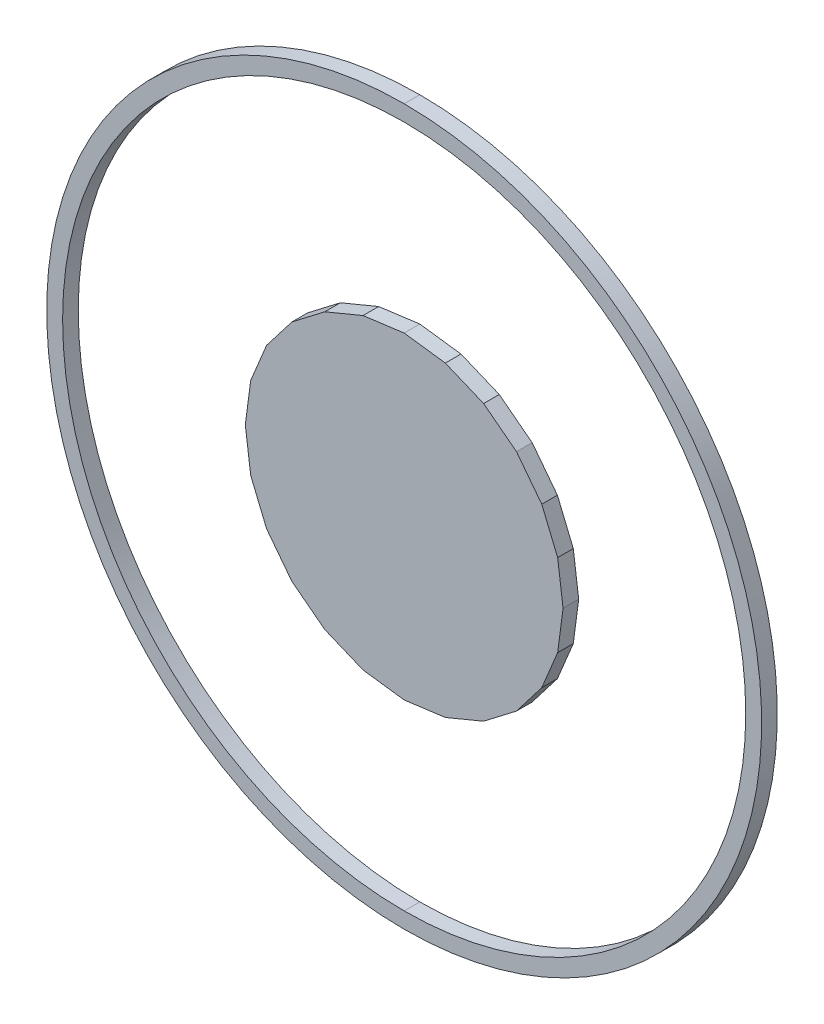
ISO-10303-21;
HEADER;
FILE_DESCRIPTION(('STEP AP214'),'2;1');
FILE_NAME('part.step','',(''),(''),'','','');
FILE_SCHEMA(('AUTOMOTIVE_DESIGN { 1 0 10303 214 1 1 1 1 }'));
ENDSEC;
DATA;
#1=APPLICATION_CONTEXT('core data for automotive mechanical design processes');
#2=APPLICATION_PROTOCOL_DEFINITION('international standard','automotive_design',2000,#1);
#3=PRODUCT_CONTEXT('',#1,'mechanical');
#4=PRODUCT('Part','Part','',(#3));
#5=PRODUCT_RELATED_PRODUCT_CATEGORY('part','',(#4));
#6=PRODUCT_DEFINITION_FORMATION('','',#4);
#7=PRODUCT_DEFINITION_CONTEXT('part definition',#1,'design');
#8=PRODUCT_DEFINITION('design','',#6,#7);
#9=PRODUCT_DEFINITION_SHAPE('','',#8);
#10=(LENGTH_UNIT() NAMED_UNIT(*) SI_UNIT(.MILLI.,.METRE.));
#11=(NAMED_UNIT(*) PLANE_ANGLE_UNIT() SI_UNIT($,.RADIAN.));
#12=(NAMED_UNIT(*) SI_UNIT($,.STERADIAN.) SOLID_ANGLE_UNIT());
#13=UNCERTAINTY_MEASURE_WITH_UNIT(LENGTH_MEASURE(1.E-05),#10,'distance_accuracy_value','');
#14=(GEOMETRIC_REPRESENTATION_CONTEXT(3) GLOBAL_UNCERTAINTY_ASSIGNED_CONTEXT((#13)) GLOBAL_UNIT_ASSIGNED_CONTEXT((#10,
#11,#12)) REPRESENTATION_CONTEXT('',''));
#15=CARTESIAN_POINT('',(0.,0.,0.));
#16=DIRECTION('',(0.,0.,1.));
#17=DIRECTION('',(1.,0.,0.));
#18=AXIS2_PLACEMENT_3D('',#15,#16,#17);
#19=CARTESIAN_POINT('',(0.,0.508,0.));
#20=DIRECTION('',(-0.130157426935396,0.991493340478673,0.));
#21=DIRECTION('',(0.,0.,1.));
#22=AXIS2_PLACEMENT_3D('',#19,#20,#21);
#23=PLANE('',#22);
#24=DIRECTION('',(0.,0.,1.));
#25=VECTOR('',#24,1.);
#26=CARTESIAN_POINT('',(-0.131572,0.490728,0.));
#27=LINE('',#26,#25);
#28=CARTESIAN_POINT('',(-0.131572,0.490728,0.));
#29=VERTEX_POINT('',#28);
#30=CARTESIAN_POINT('',(-0.131572,0.490728,0.05));
#31=VERTEX_POINT('',#30);
#32=EDGE_CURVE('P0_E11',#29,#31,#27,.T.);
#33=ORIENTED_EDGE('',*,*,#32,.T.);
#34=DIRECTION('',(-0.991493340478673,-0.130157426935396,0.));
#35=VECTOR('',#34,1.);
#36=CARTESIAN_POINT('',(0.,0.508,0.05));
#37=LINE('',#36,#35);
#38=CARTESIAN_POINT('',(0.,0.508,0.05));
#39=VERTEX_POINT('',#38);
#40=EDGE_CURVE('P0_E296',#39,#31,#37,.T.);
#41=ORIENTED_EDGE('',*,*,#40,.F.);
#42=DIRECTION('',(0.,0.,1.));
#43=VECTOR('',#42,1.);
#44=CARTESIAN_POINT('',(0.,0.508,0.));
#45=LINE('',#44,#43);
#46=CARTESIAN_POINT('',(0.,0.508,0.));
#47=VERTEX_POINT('',#46);
#48=EDGE_CURVE('P0_E423',#47,#39,#45,.T.);
#49=ORIENTED_EDGE('',*,*,#48,.F.);
#50=DIRECTION('',(-0.991493340478673,-0.130157426935396,0.));
#51=VECTOR('',#50,1.);
#52=CARTESIAN_POINT('',(0.,0.508,0.));
#53=LINE('',#52,#51);
#54=EDGE_CURVE('P0_E22',#47,#29,#53,.T.);
#55=ORIENTED_EDGE('',*,*,#54,.T.);
#56=EDGE_LOOP('',(#33,#41,#49,#55));
#57=FACE_BOUND('',#56,.T.);
#58=ADVANCED_FACE('P0_F18',(#57),#23,.T.);
#59=CARTESIAN_POINT('',(-0.131572,0.490728,0.));
#60=DIRECTION('',(-0.383254300605684,0.923642864459661,0.));
#61=DIRECTION('',(0.,0.,1.));
#62=AXIS2_PLACEMENT_3D('',#59,#60,#61);
#63=PLANE('',#62);
#64=DIRECTION('',(0.,0.,1.));
#65=VECTOR('',#64,1.);
#66=CARTESIAN_POINT('',(-0.254,0.439928,0.));
#67=LINE('',#66,#65);
#68=CARTESIAN_POINT('',(-0.254,0.439928,0.));
#69=VERTEX_POINT('',#68);
#70=CARTESIAN_POINT('',(-0.254,0.439928,0.05));
#71=VERTEX_POINT('',#70);
#72=EDGE_CURVE('P0_E29',#69,#71,#67,.T.);
#73=ORIENTED_EDGE('',*,*,#72,.T.);
#74=DIRECTION('',(-0.923642864459661,-0.383254300605684,0.));
#75=VECTOR('',#74,1.);
#76=CARTESIAN_POINT('',(-0.131572,0.490728,0.05));
#77=LINE('',#76,#75);
#78=EDGE_CURVE('P0_E304',#31,#71,#77,.T.);
#79=ORIENTED_EDGE('',*,*,#78,.F.);
#80=ORIENTED_EDGE('',*,*,#32,.F.);
#81=DIRECTION('',(-0.923642864459661,-0.383254300605684,0.));
#82=VECTOR('',#81,1.);
#83=CARTESIAN_POINT('',(-0.131572,0.490728,0.));
#84=LINE('',#83,#82);
#85=EDGE_CURVE('P0_E394',#29,#69,#84,.T.);
#86=ORIENTED_EDGE('',*,*,#85,.T.);
#87=EDGE_LOOP('',(#73,#79,#80,#86));
#88=FACE_BOUND('',#87,.T.);
#89=ADVANCED_FACE('P0_F535',(#88),#63,.T.);
#90=CARTESIAN_POINT('',(-0.254,0.439928,0.));
#91=DIRECTION('',(-0.609155163492906,0.793051061905808,0.));
#92=DIRECTION('',(0.,0.,1.));
#93=AXIS2_PLACEMENT_3D('',#90,#91,#92);
#94=PLANE('',#93);
#95=DIRECTION('',(0.,0.,1.));
#96=VECTOR('',#95,1.);
#97=CARTESIAN_POINT('',(-0.359156,0.359156,0.));
#98=LINE('',#97,#96);
#99=CARTESIAN_POINT('',(-0.359156,0.359156,0.));
#100=VERTEX_POINT('',#99);
#101=CARTESIAN_POINT('',(-0.359156,0.359156,0.05));
#102=VERTEX_POINT('',#101);
#103=EDGE_CURVE('P0_E271',#100,#102,#98,.T.);
#104=ORIENTED_EDGE('',*,*,#103,.T.);
#105=DIRECTION('',(-0.793051061905808,-0.609155163492907,0.));
#106=VECTOR('',#105,1.);
#107=CARTESIAN_POINT('',(-0.254,0.439928,0.05));
#108=LINE('',#107,#106);
#109=EDGE_CURVE('P0_E449',#71,#102,#108,.T.);
#110=ORIENTED_EDGE('',*,*,#109,.F.);
#111=ORIENTED_EDGE('',*,*,#72,.F.);
#112=DIRECTION('',(-0.793051061905808,-0.609155163492907,0.));
#113=VECTOR('',#112,1.);
#114=CARTESIAN_POINT('',(-0.254,0.439928,0.));
#115=LINE('',#114,#113);
#116=EDGE_CURVE('P0_E279',#69,#100,#115,.T.);
#117=ORIENTED_EDGE('',*,*,#116,.T.);
#118=EDGE_LOOP('',(#104,#110,#111,#117));
#119=FACE_BOUND('',#118,.T.);
#120=ADVANCED_FACE('P0_F542',(#119),#94,.T.);
#121=CARTESIAN_POINT('',(-0.359156,0.359156,0.));
#122=DIRECTION('',(-0.793051061905808,0.609155163492906,0.));
#123=DIRECTION('',(0.,0.,1.));
#124=AXIS2_PLACEMENT_3D('',#121,#122,#123);
#125=PLANE('',#124);
#126=DIRECTION('',(0.,0.,1.));
#127=VECTOR('',#126,1.);
#128=CARTESIAN_POINT('',(-0.439928,0.254,0.));
#129=LINE('',#128,#127);
#130=CARTESIAN_POINT('',(-0.439928,0.254,0.));
#131=VERTEX_POINT('',#130);
#132=CARTESIAN_POINT('',(-0.439928,0.254,0.05));
#133=VERTEX_POINT('',#132);
#134=EDGE_CURVE('P0_E259',#131,#133,#129,.T.);
#135=ORIENTED_EDGE('',*,*,#134,.T.);
#136=DIRECTION('',(-0.609155163492907,-0.793051061905808,0.));
#137=VECTOR('',#136,1.);
#138=CARTESIAN_POINT('',(-0.359156,0.359156,0.05));
#139=LINE('',#138,#137);
#140=EDGE_CURVE('P0_E346',#102,#133,#139,.T.);
#141=ORIENTED_EDGE('',*,*,#140,.F.);
#142=ORIENTED_EDGE('',*,*,#103,.F.);
#143=DIRECTION('',(-0.609155163492907,-0.793051061905808,0.));
#144=VECTOR('',#143,1.);
#145=CARTESIAN_POINT('',(-0.359156,0.359156,0.));
#146=LINE('',#145,#144);
#147=EDGE_CURVE('P0_E274',#100,#131,#146,.T.);
#148=ORIENTED_EDGE('',*,*,#147,.T.);
#149=EDGE_LOOP('',(#135,#141,#142,#148));
#150=FACE_BOUND('',#149,.T.);
#151=ADVANCED_FACE('P0_F275',(#150),#125,.T.);
#152=CARTESIAN_POINT('',(-0.439928,0.254,0.));
#153=DIRECTION('',(-0.923642864459661,0.383254300605684,0.));
#154=DIRECTION('',(0.,0.,1.));
#155=AXIS2_PLACEMENT_3D('',#152,#153,#154);
#156=PLANE('',#155);
#157=DIRECTION('',(0.,0.,1.));
#158=VECTOR('',#157,1.);
#159=CARTESIAN_POINT('',(-0.490728,0.131572,0.));
#160=LINE('',#159,#158);
#161=CARTESIAN_POINT('',(-0.490728,0.131572,0.));
#162=VERTEX_POINT('',#161);
#163=CARTESIAN_POINT('',(-0.490728,0.131572,0.05));
#164=VERTEX_POINT('',#163);
#165=EDGE_CURVE('P0_E251',#162,#164,#160,.T.);
#166=ORIENTED_EDGE('',*,*,#165,.T.);
#167=DIRECTION('',(-0.383254300605684,-0.923642864459661,0.));
#168=VECTOR('',#167,1.);
#169=CARTESIAN_POINT('',(-0.439928,0.254,0.05));
#170=LINE('',#169,#168);
#171=EDGE_CURVE('P0_E266',#133,#164,#170,.T.);
#172=ORIENTED_EDGE('',*,*,#171,.F.);
#173=ORIENTED_EDGE('',*,*,#134,.F.);
#174=DIRECTION('',(-0.383254300605684,-0.923642864459661,0.));
#175=VECTOR('',#174,1.);
#176=CARTESIAN_POINT('',(-0.439928,0.254,0.));
#177=LINE('',#176,#175);
#178=EDGE_CURVE('P0_E263',#131,#162,#177,.T.);
#179=ORIENTED_EDGE('',*,*,#178,.T.);
#180=EDGE_LOOP('',(#166,#172,#173,#179));
#181=FACE_BOUND('',#180,.T.);
#182=ADVANCED_FACE('P0_F261',(#181),#156,.T.);
#183=CARTESIAN_POINT('',(-0.490728,0.131572,0.));
#184=DIRECTION('',(-0.991493340478673,0.130157426935396,0.));
#185=DIRECTION('',(0.,0.,1.));
#186=AXIS2_PLACEMENT_3D('',#183,#184,#185);
#187=PLANE('',#186);
#188=DIRECTION('',(0.,0.,1.));
#189=VECTOR('',#188,1.);
#190=CARTESIAN_POINT('',(-0.508,0.,0.));
#191=LINE('',#190,#189);
#192=CARTESIAN_POINT('',(-0.508,0.,0.));
#193=VERTEX_POINT('',#192);
#194=CARTESIAN_POINT('',(-0.508,0.,0.05));
#195=VERTEX_POINT('',#194);
#196=EDGE_CURVE('P0_E244',#193,#195,#191,.T.);
#197=ORIENTED_EDGE('',*,*,#196,.T.);
#198=DIRECTION('',(-0.130157426935396,-0.991493340478673,0.));
#199=VECTOR('',#198,1.);
#200=CARTESIAN_POINT('',(-0.490728,0.131572,0.05));
#201=LINE('',#200,#199);
#202=EDGE_CURVE('P0_E345',#164,#195,#201,.T.);
#203=ORIENTED_EDGE('',*,*,#202,.F.);
#204=ORIENTED_EDGE('',*,*,#165,.F.);
#205=DIRECTION('',(-0.130157426935396,-0.991493340478673,0.));
#206=VECTOR('',#205,1.);
#207=CARTESIAN_POINT('',(-0.490728,0.131572,0.));
#208=LINE('',#207,#206);
#209=EDGE_CURVE('P0_E284',#162,#193,#208,.T.);
#210=ORIENTED_EDGE('',*,*,#209,.T.);
#211=EDGE_LOOP('',(#197,#203,#204,#210));
#212=FACE_BOUND('',#211,.T.);
#213=ADVANCED_FACE('P0_F521',(#212),#187,.T.);
#214=CARTESIAN_POINT('',(-0.508,0.,0.));
#215=DIRECTION('',(-0.991493340478673,-0.130157426935396,0.));
#216=DIRECTION('',(-0.130157426935396,0.991493340478673,0.));
#217=AXIS2_PLACEMENT_3D('',#214,#215,#216);
#218=PLANE('',#217);
#219=DIRECTION('',(0.,0.,1.));
#220=VECTOR('',#219,1.);
#221=CARTESIAN_POINT('',(-0.490728,-0.131572,0.));
#222=LINE('',#221,#220);
#223=CARTESIAN_POINT('',(-0.490728,-0.131572,0.));
#224=VERTEX_POINT('',#223);
#225=CARTESIAN_POINT('',(-0.490728,-0.131572,0.05));
#226=VERTEX_POINT('',#225);
#227=EDGE_CURVE('P0_E238',#224,#226,#222,.T.);
#228=ORIENTED_EDGE('',*,*,#227,.T.);
#229=DIRECTION('',(0.130157426935396,-0.991493340478673,0.));
#230=VECTOR('',#229,1.);
#231=CARTESIAN_POINT('',(-0.508,0.,0.05));
#232=LINE('',#231,#230);
#233=EDGE_CURVE('P0_E326',#195,#226,#232,.T.);
#234=ORIENTED_EDGE('',*,*,#233,.F.);
#235=ORIENTED_EDGE('',*,*,#196,.F.);
#236=DIRECTION('',(0.130157426935396,-0.991493340478673,0.));
#237=VECTOR('',#236,1.);
#238=CARTESIAN_POINT('',(-0.508,0.,0.));
#239=LINE('',#238,#237);
#240=EDGE_CURVE('P0_E292',#193,#224,#239,.T.);
#241=ORIENTED_EDGE('',*,*,#240,.T.);
#242=EDGE_LOOP('',(#228,#234,#235,#241));
#243=FACE_BOUND('',#242,.T.);
#244=ADVANCED_FACE('P0_F520',(#243),#218,.T.);
#245=CARTESIAN_POINT('',(-0.490728,-0.131572,0.));
#246=DIRECTION('',(-0.923642864459661,-0.383254300605684,0.));
#247=DIRECTION('',(-0.383254300605684,0.923642864459661,0.));
#248=AXIS2_PLACEMENT_3D('',#245,#246,#247);
#249=PLANE('',#248);
#250=DIRECTION('',(0.,0.,1.));
#251=VECTOR('',#250,1.);
#252=CARTESIAN_POINT('',(-0.439928,-0.254,0.));
#253=LINE('',#252,#251);
#254=CARTESIAN_POINT('',(-0.439928,-0.254,0.));
#255=VERTEX_POINT('',#254);
#256=CARTESIAN_POINT('',(-0.439928,-0.254,0.05));
#257=VERTEX_POINT('',#256);
#258=EDGE_CURVE('P0_E393',#255,#257,#253,.T.);
#259=ORIENTED_EDGE('',*,*,#258,.T.);
#260=DIRECTION('',(0.383254300605684,-0.923642864459661,0.));
#261=VECTOR('',#260,1.);
#262=CARTESIAN_POINT('',(-0.490728,-0.131572,0.05));
#263=LINE('',#262,#261);
#264=EDGE_CURVE('P0_E321',#226,#257,#263,.T.);
#265=ORIENTED_EDGE('',*,*,#264,.F.);
#266=ORIENTED_EDGE('',*,*,#227,.F.);
#267=DIRECTION('',(0.383254300605684,-0.923642864459661,0.));
#268=VECTOR('',#267,1.);
#269=CARTESIAN_POINT('',(-0.490728,-0.131572,0.));
#270=LINE('',#269,#268);
#271=EDGE_CURVE('P0_E360',#224,#255,#270,.T.);
#272=ORIENTED_EDGE('',*,*,#271,.T.);
#273=EDGE_LOOP('',(#259,#265,#266,#272));
#274=FACE_BOUND('',#273,.T.);
#275=ADVANCED_FACE('P0_F20',(#274),#249,.T.);
#276=CARTESIAN_POINT('',(-0.439928,-0.254,0.));
#277=DIRECTION('',(-0.793051061905808,-0.609155163492906,0.));
#278=DIRECTION('',(-0.609155163492906,0.793051061905808,0.));
#279=AXIS2_PLACEMENT_3D('',#276,#277,#278);
#280=PLANE('',#279);
#281=DIRECTION('',(0.,0.,1.));
#282=VECTOR('',#281,1.);
#283=CARTESIAN_POINT('',(-0.359156,-0.359156,0.));
#284=LINE('',#283,#282);
#285=CARTESIAN_POINT('',(-0.359156,-0.359156,0.));
#286=VERTEX_POINT('',#285);
#287=CARTESIAN_POINT('',(-0.359156,-0.359156,0.05));
#288=VERTEX_POINT('',#287);
#289=EDGE_CURVE('P0_E43',#286,#288,#284,.T.);
#290=ORIENTED_EDGE('',*,*,#289,.T.);
#291=DIRECTION('',(0.609155163492907,-0.793051061905808,0.));
#292=VECTOR('',#291,1.);
#293=CARTESIAN_POINT('',(-0.439928,-0.254,0.05));
#294=LINE('',#293,#292);
#295=EDGE_CURVE('P0_E325',#257,#288,#294,.T.);
#296=ORIENTED_EDGE('',*,*,#295,.F.);
#297=ORIENTED_EDGE('',*,*,#258,.F.);
#298=DIRECTION('',(0.609155163492907,-0.793051061905808,0.));
#299=VECTOR('',#298,1.);
#300=CARTESIAN_POINT('',(-0.439928,-0.254,0.));
#301=LINE('',#300,#299);
#302=EDGE_CURVE('P0_E385',#255,#286,#301,.T.);
#303=ORIENTED_EDGE('',*,*,#302,.T.);
#304=EDGE_LOOP('',(#290,#296,#297,#303));
#305=FACE_BOUND('',#304,.T.);
#306=ADVANCED_FACE('P0_F516',(#305),#280,.T.);
#307=CARTESIAN_POINT('',(-0.359156,-0.359156,0.));
#308=DIRECTION('',(-0.609155163492906,-0.793051061905808,0.));
#309=DIRECTION('',(-0.793051061905808,0.609155163492906,0.));
#310=AXIS2_PLACEMENT_3D('',#307,#308,#309);
#311=PLANE('',#310);
#312=DIRECTION('',(0.,0.,1.));
#313=VECTOR('',#312,1.);
#314=CARTESIAN_POINT('',(-0.254,-0.439928,0.));
#315=LINE('',#314,#313);
#316=CARTESIAN_POINT('',(-0.254,-0.439928,0.));
#317=VERTEX_POINT('',#316);
#318=CARTESIAN_POINT('',(-0.254,-0.439928,0.05));
#319=VERTEX_POINT('',#318);
#320=EDGE_CURVE('P0_E367',#317,#319,#315,.T.);
#321=ORIENTED_EDGE('',*,*,#320,.T.);
#322=DIRECTION('',(0.793051061905808,-0.609155163492907,0.));
#323=VECTOR('',#322,1.);
#324=CARTESIAN_POINT('',(-0.359156,-0.359156,0.05));
#325=LINE('',#324,#323);
#326=EDGE_CURVE('P0_E330',#288,#319,#325,.T.);
#327=ORIENTED_EDGE('',*,*,#326,.F.);
#328=ORIENTED_EDGE('',*,*,#289,.F.);
#329=DIRECTION('',(0.793051061905808,-0.609155163492907,0.));
#330=VECTOR('',#329,1.);
#331=CARTESIAN_POINT('',(-0.359156,-0.359156,0.));
#332=LINE('',#331,#330);
#333=EDGE_CURVE('P0_E382',#286,#317,#332,.T.);
#334=ORIENTED_EDGE('',*,*,#333,.T.);
#335=EDGE_LOOP('',(#321,#327,#328,#334));
#336=FACE_BOUND('',#335,.T.);
#337=ADVANCED_FACE('P0_F584',(#336),#311,.T.);
#338=CARTESIAN_POINT('',(0.,0.,0.05));
#339=DIRECTION('',(0.,0.,1.));
#340=DIRECTION('',(1.,0.,0.));
#341=AXIS2_PLACEMENT_3D('',#338,#339,#340);
#342=PLANE('',#341);
#343=ORIENTED_EDGE('',*,*,#40,.T.);
#344=ORIENTED_EDGE('',*,*,#78,.T.);
#345=ORIENTED_EDGE('',*,*,#109,.T.);
#346=ORIENTED_EDGE('',*,*,#140,.T.);
#347=ORIENTED_EDGE('',*,*,#171,.T.);
#348=ORIENTED_EDGE('',*,*,#202,.T.);
#349=ORIENTED_EDGE('',*,*,#233,.T.);
#350=ORIENTED_EDGE('',*,*,#264,.T.);
#351=ORIENTED_EDGE('',*,*,#295,.T.);
#352=ORIENTED_EDGE('',*,*,#326,.T.);
#353=DIRECTION('',(0.923642864459661,-0.383254300605684,0.));
#354=VECTOR('',#353,1.);
#355=CARTESIAN_POINT('',(-0.254,-0.439928,0.05));
#356=LINE('',#355,#354);
#357=CARTESIAN_POINT('',(-0.131572,-0.490728,0.05));
#358=VERTEX_POINT('',#357);
#359=EDGE_CURVE('P0_E364',#319,#358,#356,.T.);
#360=ORIENTED_EDGE('',*,*,#359,.T.);
#361=DIRECTION('',(0.991493340478673,-0.130157426935396,0.));
#362=VECTOR('',#361,1.);
#363=CARTESIAN_POINT('',(-0.131572,-0.490728,0.05));
#364=LINE('',#363,#362);
#365=CARTESIAN_POINT('',(0.,-0.508,0.05));
#366=VERTEX_POINT('',#365);
#367=EDGE_CURVE('P0_E96',#358,#366,#364,.T.);
#368=ORIENTED_EDGE('',*,*,#367,.T.);
#369=DIRECTION('',(0.991493340478673,0.130157426935396,0.));
#370=VECTOR('',#369,1.);
#371=CARTESIAN_POINT('',(0.,-0.508,0.05));
#372=LINE('',#371,#370);
#373=CARTESIAN_POINT('',(0.131572,-0.490728,0.05));
#374=VERTEX_POINT('',#373);
#375=EDGE_CURVE('P0_E320',#366,#374,#372,.T.);
#376=ORIENTED_EDGE('',*,*,#375,.T.);
#377=DIRECTION('',(0.923642864459661,0.383254300605684,0.));
#378=VECTOR('',#377,1.);
#379=CARTESIAN_POINT('',(0.131572,-0.490728,0.05));
#380=LINE('',#379,#378);
#381=CARTESIAN_POINT('',(0.254,-0.439928,0.05));
#382=VERTEX_POINT('',#381);
#383=EDGE_CURVE('P0_E353',#374,#382,#380,.T.);
#384=ORIENTED_EDGE('',*,*,#383,.T.);
#385=DIRECTION('',(0.793051061905808,0.609155163492907,0.));
#386=VECTOR('',#385,1.);
#387=CARTESIAN_POINT('',(0.254,-0.439928,0.05));
#388=LINE('',#387,#386);
#389=CARTESIAN_POINT('',(0.359156,-0.359156,0.05));
#390=VERTEX_POINT('',#389);
#391=EDGE_CURVE('P0_E300',#382,#390,#388,.T.);
#392=ORIENTED_EDGE('',*,*,#391,.T.);
#393=DIRECTION('',(0.609155163492907,0.793051061905808,0.));
#394=VECTOR('',#393,1.);
#395=CARTESIAN_POINT('',(0.359156,-0.359156,0.05));
#396=LINE('',#395,#394);
#397=CARTESIAN_POINT('',(0.439928,-0.254,0.05));
#398=VERTEX_POINT('',#397);
#399=EDGE_CURVE('P0_E301',#390,#398,#396,.T.);
#400=ORIENTED_EDGE('',*,*,#399,.T.);
#401=DIRECTION('',(0.383254300605684,0.923642864459661,0.));
#402=VECTOR('',#401,1.);
#403=CARTESIAN_POINT('',(0.439928,-0.254,0.05));
#404=LINE('',#403,#402);
#405=CARTESIAN_POINT('',(0.490728,-0.131572,0.05));
#406=VERTEX_POINT('',#405);
#407=EDGE_CURVE('P0_E336',#398,#406,#404,.T.);
#408=ORIENTED_EDGE('',*,*,#407,.T.);
#409=DIRECTION('',(0.130157426935396,0.991493340478673,0.));
#410=VECTOR('',#409,1.);
#411=CARTESIAN_POINT('',(0.490728,-0.131572,0.05));
#412=LINE('',#411,#410);
#413=CARTESIAN_POINT('',(0.508,0.,0.05));
#414=VERTEX_POINT('',#413);
#415=EDGE_CURVE('P0_E357',#406,#414,#412,.T.);
#416=ORIENTED_EDGE('',*,*,#415,.T.);
#417=DIRECTION('',(-0.130157426935396,0.991493340478673,0.));
#418=VECTOR('',#417,1.);
#419=CARTESIAN_POINT('',(0.508,0.,0.05));
#420=LINE('',#419,#418);
#421=CARTESIAN_POINT('',(0.490728,0.131572,0.05));
#422=VERTEX_POINT('',#421);
#423=EDGE_CURVE('P0_E306',#414,#422,#420,.T.);
#424=ORIENTED_EDGE('',*,*,#423,.T.);
#425=DIRECTION('',(-0.383254300605684,0.923642864459661,0.));
#426=VECTOR('',#425,1.);
#427=CARTESIAN_POINT('',(0.490728,0.131572,0.05));
#428=LINE('',#427,#426);
#429=CARTESIAN_POINT('',(0.439928,0.254,0.05));
#430=VERTEX_POINT('',#429);
#431=EDGE_CURVE('P0_E380',#422,#430,#428,.T.);
#432=ORIENTED_EDGE('',*,*,#431,.T.);
#433=DIRECTION('',(-0.609155163492907,0.793051061905808,0.));
#434=VECTOR('',#433,1.);
#435=CARTESIAN_POINT('',(0.439928,0.254,0.05));
#436=LINE('',#435,#434);
#437=CARTESIAN_POINT('',(0.359156,0.359156,0.05));
#438=VERTEX_POINT('',#437);
#439=EDGE_CURVE('P0_E381',#430,#438,#436,.T.);
#440=ORIENTED_EDGE('',*,*,#439,.T.);
#441=DIRECTION('',(-0.793051061905808,0.609155163492907,0.));
#442=VECTOR('',#441,1.);
#443=CARTESIAN_POINT('',(0.359156,0.359156,0.05));
#444=LINE('',#443,#442);
#445=CARTESIAN_POINT('',(0.254,0.439928,0.05));
#446=VERTEX_POINT('',#445);
#447=EDGE_CURVE('P0_E331',#438,#446,#444,.T.);
#448=ORIENTED_EDGE('',*,*,#447,.T.);
#449=DIRECTION('',(-0.923642864459661,0.383254300605684,0.));
#450=VECTOR('',#449,1.);
#451=CARTESIAN_POINT('',(0.254,0.439928,0.05));
#452=LINE('',#451,#450);
#453=CARTESIAN_POINT('',(0.131572,0.490728,0.05));
#454=VERTEX_POINT('',#453);
#455=EDGE_CURVE('P0_E316',#446,#454,#452,.T.);
#456=ORIENTED_EDGE('',*,*,#455,.T.);
#457=DIRECTION('',(-0.991493340478673,0.130157426935396,0.));
#458=VECTOR('',#457,1.);
#459=CARTESIAN_POINT('',(0.131572,0.490728,0.05));
#460=LINE('',#459,#458);
#461=EDGE_CURVE('P0_E317',#454,#39,#460,.T.);
#462=ORIENTED_EDGE('',*,*,#461,.T.);
#463=EDGE_LOOP('',(#343,#344,#345,#346,#347,#348,#349,#350,#351,#352,#360,#368,#376,#384,#392,
#400,#408,#416,#424,#432,#440,#448,#456,#462));
#464=FACE_BOUND('',#463,.T.);
#465=ADVANCED_FACE('P0_F518',(#464),#342,.T.);
#466=CARTESIAN_POINT('',(-0.131572,-0.490728,0.));
#467=DIRECTION('',(-0.130157426935396,-0.991493340478673,0.));
#468=DIRECTION('',(-0.991493340478673,0.130157426935396,0.));
#469=AXIS2_PLACEMENT_3D('',#466,#467,#468);
#470=PLANE('',#469);
#471=DIRECTION('',(0.,0.,1.));
#472=VECTOR('',#471,1.);
#473=CARTESIAN_POINT('',(0.,-0.508,0.));
#474=LINE('',#473,#472);
#475=CARTESIAN_POINT('',(0.,-0.508,0.));
#476=VERTEX_POINT('',#475);
#477=EDGE_CURVE('P0_E297',#476,#366,#474,.T.);
#478=ORIENTED_EDGE('',*,*,#477,.T.);
#479=ORIENTED_EDGE('',*,*,#367,.F.);
#480=DIRECTION('',(0.,0.,1.));
#481=VECTOR('',#480,1.);
#482=CARTESIAN_POINT('',(-0.131572,-0.490728,0.));
#483=LINE('',#482,#481);
#484=CARTESIAN_POINT('',(-0.131572,-0.490728,0.));
#485=VERTEX_POINT('',#484);
#486=EDGE_CURVE('P0_E368',#485,#358,#483,.T.);
#487=ORIENTED_EDGE('',*,*,#486,.F.);
#488=DIRECTION('',(0.991493340478673,-0.130157426935396,0.));
#489=VECTOR('',#488,1.);
#490=CARTESIAN_POINT('',(-0.131572,-0.490728,0.));
#491=LINE('',#490,#489);
#492=EDGE_CURVE('P0_E83',#485,#476,#491,.T.);
#493=ORIENTED_EDGE('',*,*,#492,.T.);
#494=EDGE_LOOP('',(#478,#479,#487,#493));
#495=FACE_BOUND('',#494,.T.);
#496=ADVANCED_FACE('P0_F576',(#495),#470,.T.);
#497=CARTESIAN_POINT('',(0.,-0.508,0.));
#498=DIRECTION('',(0.130157426935396,-0.991493340478673,0.));
#499=DIRECTION('',(0.,0.,-1.));
#500=AXIS2_PLACEMENT_3D('',#497,#498,#499);
#501=PLANE('',#500);
#502=DIRECTION('',(0.,0.,1.));
#503=VECTOR('',#502,1.);
#504=CARTESIAN_POINT('',(0.131572,-0.490728,0.));
#505=LINE('',#504,#503);
#506=CARTESIAN_POINT('',(0.131572,-0.490728,0.));
#507=VERTEX_POINT('',#506);
#508=EDGE_CURVE('P0_E416',#507,#374,#505,.T.);
#509=ORIENTED_EDGE('',*,*,#508,.T.);
#510=ORIENTED_EDGE('',*,*,#375,.F.);
#511=ORIENTED_EDGE('',*,*,#477,.F.);
#512=DIRECTION('',(0.991493340478673,0.130157426935396,0.));
#513=VECTOR('',#512,1.);
#514=CARTESIAN_POINT('',(0.,-0.508,0.));
#515=LINE('',#514,#513);
#516=EDGE_CURVE('P0_E400',#476,#507,#515,.T.);
#517=ORIENTED_EDGE('',*,*,#516,.T.);
#518=EDGE_LOOP('',(#509,#510,#511,#517));
#519=FACE_BOUND('',#518,.T.);
#520=ADVANCED_FACE('P0_F546',(#519),#501,.T.);
#521=CARTESIAN_POINT('',(0.131572,-0.490728,0.));
#522=DIRECTION('',(0.383254300605684,-0.923642864459661,0.));
#523=DIRECTION('',(0.,0.,-1.));
#524=AXIS2_PLACEMENT_3D('',#521,#522,#523);
#525=PLANE('',#524);
#526=DIRECTION('',(0.,0.,1.));
#527=VECTOR('',#526,1.);
#528=CARTESIAN_POINT('',(0.254,-0.439928,0.));
#529=LINE('',#528,#527);
#530=CARTESIAN_POINT('',(0.254,-0.439928,0.));
#531=VERTEX_POINT('',#530);
#532=EDGE_CURVE('P0_E349',#531,#382,#529,.T.);
#533=ORIENTED_EDGE('',*,*,#532,.T.);
#534=ORIENTED_EDGE('',*,*,#383,.F.);
#535=ORIENTED_EDGE('',*,*,#508,.F.);
#536=DIRECTION('',(0.923642864459661,0.383254300605684,0.));
#537=VECTOR('',#536,1.);
#538=CARTESIAN_POINT('',(0.131572,-0.490728,0.));
#539=LINE('',#538,#537);
#540=EDGE_CURVE('P0_E435',#507,#531,#539,.T.);
#541=ORIENTED_EDGE('',*,*,#540,.T.);
#542=EDGE_LOOP('',(#533,#534,#535,#541));
#543=FACE_BOUND('',#542,.T.);
#544=ADVANCED_FACE('P0_F589',(#543),#525,.T.);
#545=CARTESIAN_POINT('',(0.254,-0.439928,0.));
#546=DIRECTION('',(0.609155163492906,-0.793051061905808,0.));
#547=DIRECTION('',(0.,0.,-1.));
#548=AXIS2_PLACEMENT_3D('',#545,#546,#547);
#549=PLANE('',#548);
#550=DIRECTION('',(0.,0.,1.));
#551=VECTOR('',#550,1.);
#552=CARTESIAN_POINT('',(0.359156,-0.359156,0.));
#553=LINE('',#552,#551);
#554=CARTESIAN_POINT('',(0.359156,-0.359156,0.));
#555=VERTEX_POINT('',#554);
#556=EDGE_CURVE('P0_E152',#555,#390,#553,.T.);
#557=ORIENTED_EDGE('',*,*,#556,.T.);
#558=ORIENTED_EDGE('',*,*,#391,.F.);
#559=ORIENTED_EDGE('',*,*,#532,.F.);
#560=DIRECTION('',(0.793051061905808,0.609155163492907,0.));
#561=VECTOR('',#560,1.);
#562=CARTESIAN_POINT('',(0.254,-0.439928,0.));
#563=LINE('',#562,#561);
#564=EDGE_CURVE('P0_E403',#531,#555,#563,.T.);
#565=ORIENTED_EDGE('',*,*,#564,.T.);
#566=EDGE_LOOP('',(#557,#558,#559,#565));
#567=FACE_BOUND('',#566,.T.);
#568=ADVANCED_FACE('P0_F587',(#567),#549,.T.);
#569=CARTESIAN_POINT('',(0.359156,-0.359156,0.));
#570=DIRECTION('',(0.793051061905808,-0.609155163492906,0.));
#571=DIRECTION('',(0.,0.,-1.));
#572=AXIS2_PLACEMENT_3D('',#569,#570,#571);
#573=PLANE('',#572);
#574=DIRECTION('',(0.,0.,1.));
#575=VECTOR('',#574,1.);
#576=CARTESIAN_POINT('',(0.439928,-0.254,0.));
#577=LINE('',#576,#575);
#578=CARTESIAN_POINT('',(0.439928,-0.254,0.));
#579=VERTEX_POINT('',#578);
#580=EDGE_CURVE('P0_E167',#579,#398,#577,.T.);
#581=ORIENTED_EDGE('',*,*,#580,.T.);
#582=ORIENTED_EDGE('',*,*,#399,.F.);
#583=ORIENTED_EDGE('',*,*,#556,.F.);
#584=DIRECTION('',(0.609155163492907,0.793051061905808,0.));
#585=VECTOR('',#584,1.);
#586=CARTESIAN_POINT('',(0.359156,-0.359156,0.));
#587=LINE('',#586,#585);
#588=EDGE_CURVE('P0_E372',#555,#579,#587,.T.);
#589=ORIENTED_EDGE('',*,*,#588,.T.);
#590=EDGE_LOOP('',(#581,#582,#583,#589));
#591=FACE_BOUND('',#590,.T.);
#592=ADVANCED_FACE('P0_F581',(#591),#573,.T.);
#593=CARTESIAN_POINT('',(0.439928,-0.254,0.));
#594=DIRECTION('',(0.923642864459661,-0.383254300605684,0.));
#595=DIRECTION('',(0.,0.,-1.));
#596=AXIS2_PLACEMENT_3D('',#593,#594,#595);
#597=PLANE('',#596);
#598=DIRECTION('',(0.,0.,1.));
#599=VECTOR('',#598,1.);
#600=CARTESIAN_POINT('',(0.490728,-0.131572,0.));
#601=LINE('',#600,#599);
#602=CARTESIAN_POINT('',(0.490728,-0.131572,0.));
#603=VERTEX_POINT('',#602);
#604=EDGE_CURVE('P0_E340',#603,#406,#601,.T.);
#605=ORIENTED_EDGE('',*,*,#604,.T.);
#606=ORIENTED_EDGE('',*,*,#407,.F.);
#607=ORIENTED_EDGE('',*,*,#580,.F.);
#608=DIRECTION('',(0.383254300605684,0.923642864459661,0.));
#609=VECTOR('',#608,1.);
#610=CARTESIAN_POINT('',(0.439928,-0.254,0.));
#611=LINE('',#610,#609);
#612=EDGE_CURVE('P0_E369',#579,#603,#611,.T.);
#613=ORIENTED_EDGE('',*,*,#612,.T.);
#614=EDGE_LOOP('',(#605,#606,#607,#613));
#615=FACE_BOUND('',#614,.T.);
#616=ADVANCED_FACE('P0_F578',(#615),#597,.T.);
#617=CARTESIAN_POINT('',(0.490728,-0.131572,0.));
#618=DIRECTION('',(0.991493340478673,-0.130157426935396,0.));
#619=DIRECTION('',(0.,0.,-1.));
#620=AXIS2_PLACEMENT_3D('',#617,#618,#619);
#621=PLANE('',#620);
#622=DIRECTION('',(0.,0.,1.));
#623=VECTOR('',#622,1.);
#624=CARTESIAN_POINT('',(0.508,0.,0.));
#625=LINE('',#624,#623);
#626=CARTESIAN_POINT('',(0.508,0.,0.));
#627=VERTEX_POINT('',#626);
#628=EDGE_CURVE('P0_E310',#627,#414,#625,.T.);
#629=ORIENTED_EDGE('',*,*,#628,.T.);
#630=ORIENTED_EDGE('',*,*,#415,.F.);
#631=ORIENTED_EDGE('',*,*,#604,.F.);
#632=DIRECTION('',(0.130157426935396,0.991493340478673,0.));
#633=VECTOR('',#632,1.);
#634=CARTESIAN_POINT('',(0.490728,-0.131572,0.));
#635=LINE('',#634,#633);
#636=EDGE_CURVE('P0_E373',#603,#627,#635,.T.);
#637=ORIENTED_EDGE('',*,*,#636,.T.);
#638=EDGE_LOOP('',(#629,#630,#631,#637));
#639=FACE_BOUND('',#638,.T.);
#640=ADVANCED_FACE('P0_F552',(#639),#621,.T.);
#641=CARTESIAN_POINT('',(0.508,0.,0.));
#642=DIRECTION('',(0.991493340478673,0.130157426935396,0.));
#643=DIRECTION('',(0.,0.,-1.));
#644=AXIS2_PLACEMENT_3D('',#641,#642,#643);
#645=PLANE('',#644);
#646=DIRECTION('',(0.,0.,1.));
#647=VECTOR('',#646,1.);
#648=CARTESIAN_POINT('',(0.490728,0.131572,0.));
#649=LINE('',#648,#647);
#650=CARTESIAN_POINT('',(0.490728,0.131572,0.));
#651=VERTEX_POINT('',#650);
#652=EDGE_CURVE('P0_E311',#651,#422,#649,.T.);
#653=ORIENTED_EDGE('',*,*,#652,.T.);
#654=ORIENTED_EDGE('',*,*,#423,.F.);
#655=ORIENTED_EDGE('',*,*,#628,.F.);
#656=DIRECTION('',(-0.130157426935396,0.991493340478673,0.));
#657=VECTOR('',#656,1.);
#658=CARTESIAN_POINT('',(0.508,0.,0.));
#659=LINE('',#658,#657);
#660=EDGE_CURVE('P0_E492',#627,#651,#659,.T.);
#661=ORIENTED_EDGE('',*,*,#660,.T.);
#662=EDGE_LOOP('',(#653,#654,#655,#661));
#663=FACE_BOUND('',#662,.T.);
#664=ADVANCED_FACE('P0_F549',(#663),#645,.T.);
#665=CARTESIAN_POINT('',(0.490728,0.131572,0.));
#666=DIRECTION('',(0.923642864459661,0.383254300605684,0.));
#667=DIRECTION('',(0.,0.,-1.));
#668=AXIS2_PLACEMENT_3D('',#665,#666,#667);
#669=PLANE('',#668);
#670=DIRECTION('',(0.,0.,1.));
#671=VECTOR('',#670,1.);
#672=CARTESIAN_POINT('',(0.439928,0.254,0.));
#673=LINE('',#672,#671);
#674=CARTESIAN_POINT('',(0.439928,0.254,0.));
#675=VERTEX_POINT('',#674);
#676=EDGE_CURVE('P0_E376',#675,#430,#673,.T.);
#677=ORIENTED_EDGE('',*,*,#676,.T.);
#678=ORIENTED_EDGE('',*,*,#431,.F.);
#679=ORIENTED_EDGE('',*,*,#652,.F.);
#680=DIRECTION('',(-0.383254300605684,0.923642864459661,0.));
#681=VECTOR('',#680,1.);
#682=CARTESIAN_POINT('',(0.490728,0.131572,0.));
#683=LINE('',#682,#681);
#684=EDGE_CURVE('P0_E488',#651,#675,#683,.T.);
#685=ORIENTED_EDGE('',*,*,#684,.T.);
#686=EDGE_LOOP('',(#677,#678,#679,#685));
#687=FACE_BOUND('',#686,.T.);
#688=ADVANCED_FACE('P0_F551',(#687),#669,.T.);
#689=CARTESIAN_POINT('',(0.439928,0.254,0.));
#690=DIRECTION('',(0.793051061905808,0.609155163492906,0.));
#691=DIRECTION('',(0.,0.,-1.));
#692=AXIS2_PLACEMENT_3D('',#689,#690,#691);
#693=PLANE('',#692);
#694=DIRECTION('',(0.,0.,1.));
#695=VECTOR('',#694,1.);
#696=CARTESIAN_POINT('',(0.359156,0.359156,0.));
#697=LINE('',#696,#695);
#698=CARTESIAN_POINT('',(0.359156,0.359156,0.));
#699=VERTEX_POINT('',#698);
#700=EDGE_CURVE('P0_E334',#699,#438,#697,.T.);
#701=ORIENTED_EDGE('',*,*,#700,.T.);
#702=ORIENTED_EDGE('',*,*,#439,.F.);
#703=ORIENTED_EDGE('',*,*,#676,.F.);
#704=DIRECTION('',(-0.609155163492907,0.793051061905808,0.));
#705=VECTOR('',#704,1.);
#706=CARTESIAN_POINT('',(0.439928,0.254,0.));
#707=LINE('',#706,#705);
#708=EDGE_CURVE('P0_E467',#675,#699,#707,.T.);
#709=ORIENTED_EDGE('',*,*,#708,.T.);
#710=EDGE_LOOP('',(#701,#702,#703,#709));
#711=FACE_BOUND('',#710,.T.);
#712=ADVANCED_FACE('P0_F603',(#711),#693,.T.);
#713=CARTESIAN_POINT('',(0.359156,0.359156,0.));
#714=DIRECTION('',(0.609155163492906,0.793051061905808,0.));
#715=DIRECTION('',(0.,0.,-1.));
#716=AXIS2_PLACEMENT_3D('',#713,#714,#715);
#717=PLANE('',#716);
#718=DIRECTION('',(0.,0.,1.));
#719=VECTOR('',#718,1.);
#720=CARTESIAN_POINT('',(0.254,0.439928,0.));
#721=LINE('',#720,#719);
#722=CARTESIAN_POINT('',(0.254,0.439928,0.));
#723=VERTEX_POINT('',#722);
#724=EDGE_CURVE('P0_E335',#723,#446,#721,.T.);
#725=ORIENTED_EDGE('',*,*,#724,.T.);
#726=ORIENTED_EDGE('',*,*,#447,.F.);
#727=ORIENTED_EDGE('',*,*,#700,.F.);
#728=DIRECTION('',(-0.793051061905808,0.609155163492907,0.));
#729=VECTOR('',#728,1.);
#730=CARTESIAN_POINT('',(0.359156,0.359156,0.));
#731=LINE('',#730,#729);
#732=EDGE_CURVE('P0_E463',#699,#723,#731,.T.);
#733=ORIENTED_EDGE('',*,*,#732,.T.);
#734=EDGE_LOOP('',(#725,#726,#727,#733));
#735=FACE_BOUND('',#734,.T.);
#736=ADVANCED_FACE('P0_F571',(#735),#717,.T.);
#737=CARTESIAN_POINT('',(0.254,0.439928,0.));
#738=DIRECTION('',(0.383254300605684,0.923642864459661,0.));
#739=DIRECTION('',(0.,0.,-1.));
#740=AXIS2_PLACEMENT_3D('',#737,#738,#739);
#741=PLANE('',#740);
#742=DIRECTION('',(0.,0.,1.));
#743=VECTOR('',#742,1.);
#744=CARTESIAN_POINT('',(0.131572,0.490728,0.));
#745=LINE('',#744,#743);
#746=CARTESIAN_POINT('',(0.131572,0.490728,0.));
#747=VERTEX_POINT('',#746);
#748=EDGE_CURVE('P0_E312',#747,#454,#745,.T.);
#749=ORIENTED_EDGE('',*,*,#748,.T.);
#750=ORIENTED_EDGE('',*,*,#455,.F.);
#751=ORIENTED_EDGE('',*,*,#724,.F.);
#752=DIRECTION('',(-0.923642864459661,0.383254300605684,0.));
#753=VECTOR('',#752,1.);
#754=CARTESIAN_POINT('',(0.254,0.439928,0.));
#755=LINE('',#754,#753);
#756=EDGE_CURVE('P0_E468',#723,#747,#755,.T.);
#757=ORIENTED_EDGE('',*,*,#756,.T.);
#758=EDGE_LOOP('',(#749,#750,#751,#757));
#759=FACE_BOUND('',#758,.T.);
#760=ADVANCED_FACE('P0_F564',(#759),#741,.T.);
#761=CARTESIAN_POINT('',(0.131572,0.490728,0.));
#762=DIRECTION('',(0.130157426935396,0.991493340478673,0.));
#763=DIRECTION('',(0.,0.,-1.));
#764=AXIS2_PLACEMENT_3D('',#761,#762,#763);
#765=PLANE('',#764);
#766=ORIENTED_EDGE('',*,*,#48,.T.);
#767=ORIENTED_EDGE('',*,*,#461,.F.);
#768=ORIENTED_EDGE('',*,*,#748,.F.);
#769=DIRECTION('',(-0.991493340478673,0.130157426935396,0.));
#770=VECTOR('',#769,1.);
#771=CARTESIAN_POINT('',(0.131572,0.490728,0.));
#772=LINE('',#771,#770);
#773=EDGE_CURVE('P0_E420',#747,#47,#772,.T.);
#774=ORIENTED_EDGE('',*,*,#773,.T.);
#775=EDGE_LOOP('',(#766,#767,#768,#774));
#776=FACE_BOUND('',#775,.T.);
#777=ADVANCED_FACE('P0_F556',(#776),#765,.T.);
#778=CARTESIAN_POINT('',(0.,0.,0.));
#779=DIRECTION('',(0.,0.,1.));
#780=DIRECTION('',(1.,0.,0.));
#781=AXIS2_PLACEMENT_3D('',#778,#779,#780);
#782=PLANE('',#781);
#783=ORIENTED_EDGE('',*,*,#756,.F.);
#784=ORIENTED_EDGE('',*,*,#732,.F.);
#785=ORIENTED_EDGE('',*,*,#708,.F.);
#786=ORIENTED_EDGE('',*,*,#684,.F.);
#787=ORIENTED_EDGE('',*,*,#660,.F.);
#788=ORIENTED_EDGE('',*,*,#636,.F.);
#789=ORIENTED_EDGE('',*,*,#612,.F.);
#790=ORIENTED_EDGE('',*,*,#588,.F.);
#791=ORIENTED_EDGE('',*,*,#564,.F.);
#792=ORIENTED_EDGE('',*,*,#540,.F.);
#793=ORIENTED_EDGE('',*,*,#516,.F.);
#794=ORIENTED_EDGE('',*,*,#492,.F.);
#795=DIRECTION('',(0.923642864459661,-0.383254300605684,0.));
#796=VECTOR('',#795,1.);
#797=CARTESIAN_POINT('',(-0.254,-0.439928,0.));
#798=LINE('',#797,#796);
#799=EDGE_CURVE('P0_E410',#317,#485,#798,.T.);
#800=ORIENTED_EDGE('',*,*,#799,.F.);
#801=ORIENTED_EDGE('',*,*,#333,.F.);
#802=ORIENTED_EDGE('',*,*,#302,.F.);
#803=ORIENTED_EDGE('',*,*,#271,.F.);
#804=ORIENTED_EDGE('',*,*,#240,.F.);
#805=ORIENTED_EDGE('',*,*,#209,.F.);
#806=ORIENTED_EDGE('',*,*,#178,.F.);
#807=ORIENTED_EDGE('',*,*,#147,.F.);
#808=ORIENTED_EDGE('',*,*,#116,.F.);
#809=ORIENTED_EDGE('',*,*,#85,.F.);
#810=ORIENTED_EDGE('',*,*,#54,.F.);
#811=ORIENTED_EDGE('',*,*,#773,.F.);
#812=EDGE_LOOP('',(#783,#784,#785,#786,#787,#788,#789,#790,#791,#792,#793,#794,#800,#801,#802,
#803,#804,#805,#806,#807,#808,#809,#810,#811));
#813=FACE_BOUND('',#812,.T.);
#814=ADVANCED_FACE('P0_F282',(#813),#782,.F.);
#815=CARTESIAN_POINT('',(-0.254,-0.439928,0.));
#816=DIRECTION('',(-0.383254300605684,-0.923642864459661,0.));
#817=DIRECTION('',(-0.923642864459661,0.383254300605684,0.));
#818=AXIS2_PLACEMENT_3D('',#815,#816,#817);
#819=PLANE('',#818);
#820=ORIENTED_EDGE('',*,*,#486,.T.);
#821=ORIENTED_EDGE('',*,*,#359,.F.);
#822=ORIENTED_EDGE('',*,*,#320,.F.);
#823=ORIENTED_EDGE('',*,*,#799,.T.);
#824=EDGE_LOOP('',(#820,#821,#822,#823));
#825=FACE_BOUND('',#824,.T.);
#826=ADVANCED_FACE('P0_F555',(#825),#819,.T.);
#827=CLOSED_SHELL('',(#58,#89,#120,#151,#182,#213,#244,#275,#306,#337,#465,#496,#520,#544,#568,
#592,#616,#640,#664,#688,#712,#736,#760,#777,#814,#826));
#828=MANIFOLD_SOLID_BREP('P0_B1',#827);
#829=CARTESIAN_POINT('',(0.,0.,0.));
#830=DIRECTION('',(0.,0.,1.));
#831=DIRECTION('',(1.,0.,0.));
#832=AXIS2_PLACEMENT_3D('',#829,#830,#831);
#833=CYLINDRICAL_SURFACE('',#832,1.143);
#834=DIRECTION('',(0.,0.,1.));
#835=VECTOR('',#834,1.);
#836=CARTESIAN_POINT('',(0.,1.143,0.));
#837=LINE('',#836,#835);
#838=CARTESIAN_POINT('',(0.,1.143,0.));
#839=VERTEX_POINT('',#838);
#840=CARTESIAN_POINT('',(0.,1.143,0.05));
#841=VERTEX_POINT('',#840);
#842=EDGE_CURVE('P1_E11',#839,#841,#837,.T.);
#843=ORIENTED_EDGE('',*,*,#842,.T.);
#844=CARTESIAN_POINT('',(0.,0.,0.05));
#845=DIRECTION('',(0.,0.,1.));
#846=DIRECTION('',(0.,-1.,0.));
#847=AXIS2_PLACEMENT_3D('',#844,#845,#846);
#848=CIRCLE('',#847,1.143);
#849=CARTESIAN_POINT('',(0.,-1.143,0.05));
#850=VERTEX_POINT('',#849);
#851=EDGE_CURVE('P1_E85',#850,#841,#848,.T.);
#852=ORIENTED_EDGE('',*,*,#851,.F.);
#853=DIRECTION('',(0.,0.,1.));
#854=VECTOR('',#853,1.);
#855=CARTESIAN_POINT('',(0.,-1.143,0.));
#856=LINE('',#855,#854);
#857=CARTESIAN_POINT('',(0.,-1.143,0.));
#858=VERTEX_POINT('',#857);
#859=EDGE_CURVE('P1_E29',#858,#850,#856,.T.);
#860=ORIENTED_EDGE('',*,*,#859,.F.);
#861=CARTESIAN_POINT('',(0.,0.,0.));
#862=DIRECTION('',(0.,0.,1.));
#863=DIRECTION('',(0.,-1.,0.));
#864=AXIS2_PLACEMENT_3D('',#861,#862,#863);
#865=CIRCLE('',#864,1.143);
#866=EDGE_CURVE('P1_E83',#858,#839,#865,.T.);
#867=ORIENTED_EDGE('',*,*,#866,.T.);
#868=EDGE_LOOP('',(#843,#852,#860,#867));
#869=FACE_BOUND('',#868,.T.);
#870=ADVANCED_FACE('P1_F18',(#869),#833,.T.);
#871=CARTESIAN_POINT('',(0.,0.,0.));
#872=DIRECTION('',(0.,0.,1.));
#873=DIRECTION('',(1.,0.,0.));
#874=AXIS2_PLACEMENT_3D('',#871,#872,#873);
#875=CYLINDRICAL_SURFACE('',#874,1.143);
#876=ORIENTED_EDGE('',*,*,#859,.T.);
#877=CARTESIAN_POINT('',(0.,0.,0.05));
#878=DIRECTION('',(0.,0.,1.));
#879=DIRECTION('',(0.,1.,0.));
#880=AXIS2_PLACEMENT_3D('',#877,#878,#879);
#881=CIRCLE('',#880,1.143);
#882=EDGE_CURVE('P1_E22',#841,#850,#881,.T.);
#883=ORIENTED_EDGE('',*,*,#882,.F.);
#884=ORIENTED_EDGE('',*,*,#842,.F.);
#885=CARTESIAN_POINT('',(0.,0.,0.));
#886=DIRECTION('',(0.,0.,1.));
#887=DIRECTION('',(0.,1.,0.));
#888=AXIS2_PLACEMENT_3D('',#885,#886,#887);
#889=CIRCLE('',#888,1.143);
#890=EDGE_CURVE('P1_E89',#839,#858,#889,.T.);
#891=ORIENTED_EDGE('',*,*,#890,.T.);
#892=EDGE_LOOP('',(#876,#883,#884,#891));
#893=FACE_BOUND('',#892,.T.);
#894=ADVANCED_FACE('P1_F90',(#893),#875,.T.);
#895=CARTESIAN_POINT('',(0.,0.,0.05));
#896=DIRECTION('',(0.,0.,1.));
#897=DIRECTION('',(1.,0.,0.));
#898=AXIS2_PLACEMENT_3D('',#895,#896,#897);
#899=PLANE('',#898);
#900=CARTESIAN_POINT('',(0.,0.,0.05));
#901=DIRECTION('',(0.,0.,-1.));
#902=DIRECTION('',(0.,-1.,0.));
#903=AXIS2_PLACEMENT_3D('',#900,#901,#902);
#904=CIRCLE('',#903,1.0922);
#905=CARTESIAN_POINT('',(0.,-1.0922,0.05));
#906=VERTEX_POINT('',#905);
#907=CARTESIAN_POINT('',(0.,1.0922,0.05));
#908=VERTEX_POINT('',#907);
#909=EDGE_CURVE('P1_E58',#906,#908,#904,.T.);
#910=ORIENTED_EDGE('',*,*,#909,.T.);
#911=CARTESIAN_POINT('',(0.,0.,0.05));
#912=DIRECTION('',(0.,0.,-1.));
#913=DIRECTION('',(0.,1.,0.));
#914=AXIS2_PLACEMENT_3D('',#911,#912,#913);
#915=CIRCLE('',#914,1.0922);
#916=EDGE_CURVE('P1_E104',#908,#906,#915,.T.);
#917=ORIENTED_EDGE('',*,*,#916,.T.);
#918=EDGE_LOOP('',(#910,#917));
#919=FACE_BOUND('',#918,.T.);
#920=ORIENTED_EDGE('',*,*,#851,.T.);
#921=ORIENTED_EDGE('',*,*,#882,.T.);
#922=EDGE_LOOP('',(#920,#921));
#923=FACE_BOUND('',#922,.T.);
#924=ADVANCED_FACE('P1_F122',(#919,#923),#899,.T.);
#925=CARTESIAN_POINT('',(0.,0.,0.));
#926=DIRECTION('',(0.,0.,1.));
#927=DIRECTION('',(1.,0.,0.));
#928=AXIS2_PLACEMENT_3D('',#925,#926,#927);
#929=CYLINDRICAL_SURFACE('',#928,1.0922);
#930=DIRECTION('',(0.,0.,1.));
#931=VECTOR('',#930,1.);
#932=CARTESIAN_POINT('',(0.,1.0922,0.));
#933=LINE('',#932,#931);
#934=CARTESIAN_POINT('',(0.,1.0922,0.));
#935=VERTEX_POINT('',#934);
#936=EDGE_CURVE('P1_E67',#935,#908,#933,.T.);
#937=ORIENTED_EDGE('',*,*,#936,.T.);
#938=ORIENTED_EDGE('',*,*,#909,.F.);
#939=DIRECTION('',(0.,0.,1.));
#940=VECTOR('',#939,1.);
#941=CARTESIAN_POINT('',(0.,-1.0922,0.));
#942=LINE('',#941,#940);
#943=CARTESIAN_POINT('',(0.,-1.0922,0.));
#944=VERTEX_POINT('',#943);
#945=EDGE_CURVE('P1_E112',#944,#906,#942,.T.);
#946=ORIENTED_EDGE('',*,*,#945,.F.);
#947=CARTESIAN_POINT('',(0.,0.,0.));
#948=DIRECTION('',(0.,0.,-1.));
#949=DIRECTION('',(0.,-1.,0.));
#950=AXIS2_PLACEMENT_3D('',#947,#948,#949);
#951=CIRCLE('',#950,1.0922);
#952=EDGE_CURVE('P1_E93',#944,#935,#951,.T.);
#953=ORIENTED_EDGE('',*,*,#952,.T.);
#954=EDGE_LOOP('',(#937,#938,#946,#953));
#955=FACE_BOUND('',#954,.T.);
#956=ADVANCED_FACE('P1_F126',(#955),#929,.F.);
#957=CARTESIAN_POINT('',(0.,0.,0.));
#958=DIRECTION('',(0.,0.,1.));
#959=DIRECTION('',(1.,0.,0.));
#960=AXIS2_PLACEMENT_3D('',#957,#958,#959);
#961=CYLINDRICAL_SURFACE('',#960,1.0922);
#962=ORIENTED_EDGE('',*,*,#945,.T.);
#963=ORIENTED_EDGE('',*,*,#916,.F.);
#964=ORIENTED_EDGE('',*,*,#936,.F.);
#965=CARTESIAN_POINT('',(0.,0.,0.));
#966=DIRECTION('',(0.,0.,-1.));
#967=DIRECTION('',(0.,1.,0.));
#968=AXIS2_PLACEMENT_3D('',#965,#966,#967);
#969=CIRCLE('',#968,1.0922);
#970=EDGE_CURVE('P1_E108',#935,#944,#969,.T.);
#971=ORIENTED_EDGE('',*,*,#970,.T.);
#972=EDGE_LOOP('',(#962,#963,#964,#971));
#973=FACE_BOUND('',#972,.T.);
#974=ADVANCED_FACE('P1_F124',(#973),#961,.F.);
#975=CARTESIAN_POINT('',(0.,0.,0.));
#976=DIRECTION('',(0.,0.,1.));
#977=DIRECTION('',(1.,0.,0.));
#978=AXIS2_PLACEMENT_3D('',#975,#976,#977);
#979=PLANE('',#978);
#980=ORIENTED_EDGE('',*,*,#952,.F.);
#981=ORIENTED_EDGE('',*,*,#970,.F.);
#982=EDGE_LOOP('',(#980,#981));
#983=FACE_BOUND('',#982,.T.);
#984=ORIENTED_EDGE('',*,*,#866,.F.);
#985=ORIENTED_EDGE('',*,*,#890,.F.);
#986=EDGE_LOOP('',(#984,#985));
#987=FACE_BOUND('',#986,.T.);
#988=ADVANCED_FACE('P1_F20',(#983,#987),#979,.F.);
#989=CLOSED_SHELL('',(#870,#894,#924,#956,#974,#988));
#990=MANIFOLD_SOLID_BREP('P1_B1',#989);
#991=ADVANCED_BREP_SHAPE_REPRESENTATION('',(#18,#828,#990),#14);
#992=SHAPE_DEFINITION_REPRESENTATION(#9,#991);
ENDSEC;
END-ISO-10303-21;
